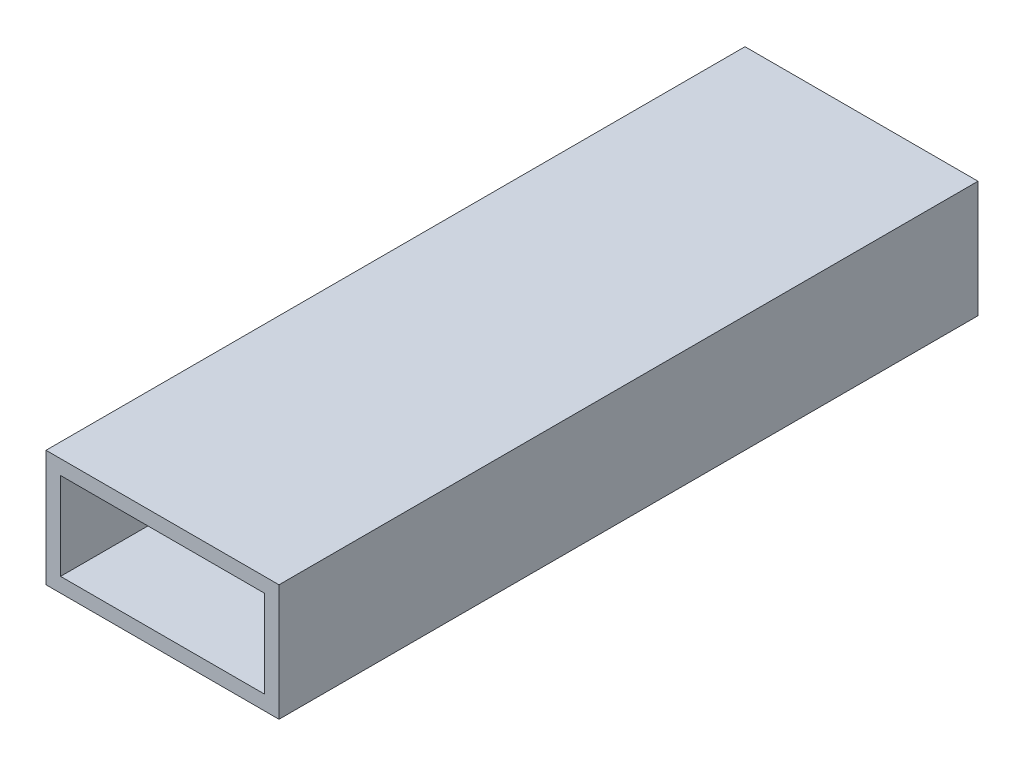
ISO-10303-21;
HEADER;
FILE_DESCRIPTION(('STEP AP214'),'2;1');
FILE_NAME('part.step','',(''),(''),'','','');
FILE_SCHEMA(('AUTOMOTIVE_DESIGN { 1 0 10303 214 1 1 1 1 }'));
ENDSEC;
DATA;
#1=APPLICATION_CONTEXT('core data for automotive mechanical design processes');
#2=APPLICATION_PROTOCOL_DEFINITION('international standard','automotive_design',2000,#1);
#3=PRODUCT_CONTEXT('',#1,'mechanical');
#4=PRODUCT('Part','Part','',(#3));
#5=PRODUCT_RELATED_PRODUCT_CATEGORY('part','',(#4));
#6=PRODUCT_DEFINITION_FORMATION('','',#4);
#7=PRODUCT_DEFINITION_CONTEXT('part definition',#1,'design');
#8=PRODUCT_DEFINITION('design','',#6,#7);
#9=PRODUCT_DEFINITION_SHAPE('','',#8);
#10=(LENGTH_UNIT() NAMED_UNIT(*) SI_UNIT(.MILLI.,.METRE.));
#11=(NAMED_UNIT(*) PLANE_ANGLE_UNIT() SI_UNIT($,.RADIAN.));
#12=(NAMED_UNIT(*) SI_UNIT($,.STERADIAN.) SOLID_ANGLE_UNIT());
#13=UNCERTAINTY_MEASURE_WITH_UNIT(LENGTH_MEASURE(1.E-05),#10,'distance_accuracy_value','');
#14=(GEOMETRIC_REPRESENTATION_CONTEXT(3) GLOBAL_UNCERTAINTY_ASSIGNED_CONTEXT((#13)) GLOBAL_UNIT_ASSIGNED_CONTEXT((#10,
#11,#12)) REPRESENTATION_CONTEXT('',''));
#15=CARTESIAN_POINT('',(0.,0.,0.));
#16=DIRECTION('',(0.,0.,1.));
#17=DIRECTION('',(1.,0.,0.));
#18=AXIS2_PLACEMENT_3D('',#15,#16,#17);
#19=CARTESIAN_POINT('',(0.,0.,152.4));
#20=DIRECTION('',(0.,0.,-1.));
#21=DIRECTION('',(-1.,0.,0.));
#22=AXIS2_PLACEMENT_3D('',#19,#20,#21);
#23=PLANE('',#22);
#24=DIRECTION('',(0.,1.,0.));
#25=VECTOR('',#24,1.);
#26=CARTESIAN_POINT('',(25.4,-12.7,152.4));
#27=LINE('',#26,#25);
#28=CARTESIAN_POINT('',(25.4,-12.7,152.4));
#29=VERTEX_POINT('',#28);
#30=CARTESIAN_POINT('',(25.4,12.7,152.4));
#31=VERTEX_POINT('',#30);
#32=EDGE_CURVE('E134',#29,#31,#27,.T.);
#33=ORIENTED_EDGE('',*,*,#32,.T.);
#34=DIRECTION('',(-1.,0.,0.));
#35=VECTOR('',#34,1.);
#36=CARTESIAN_POINT('',(-25.4,12.7,152.4));
#37=LINE('',#36,#35);
#38=CARTESIAN_POINT('',(-25.4,12.7,152.4));
#39=VERTEX_POINT('',#38);
#40=EDGE_CURVE('E137',#31,#39,#37,.T.);
#41=ORIENTED_EDGE('',*,*,#40,.T.);
#42=DIRECTION('',(0.,-1.,0.));
#43=VECTOR('',#42,1.);
#44=CARTESIAN_POINT('',(-25.4,-12.7,152.4));
#45=LINE('',#44,#43);
#46=CARTESIAN_POINT('',(-25.4,-12.7,152.4));
#47=VERTEX_POINT('',#46);
#48=EDGE_CURVE('E140',#39,#47,#45,.T.);
#49=ORIENTED_EDGE('',*,*,#48,.T.);
#50=DIRECTION('',(1.,0.,0.));
#51=VECTOR('',#50,1.);
#52=CARTESIAN_POINT('',(-25.4,-12.7,152.4));
#53=LINE('',#52,#51);
#54=EDGE_CURVE('E142',#47,#29,#53,.T.);
#55=ORIENTED_EDGE('',*,*,#54,.T.);
#56=EDGE_LOOP('',(#33,#41,#49,#55));
#57=FACE_BOUND('',#56,.T.);
#58=DIRECTION('',(0.,-1.,0.));
#59=VECTOR('',#58,1.);
#60=CARTESIAN_POINT('',(-22.225,-9.525,152.4));
#61=LINE('',#60,#59);
#62=CARTESIAN_POINT('',(-22.225,9.525,152.4));
#63=VERTEX_POINT('',#62);
#64=CARTESIAN_POINT('',(-22.225,-9.525,152.4));
#65=VERTEX_POINT('',#64);
#66=EDGE_CURVE('E98',#63,#65,#61,.T.);
#67=ORIENTED_EDGE('',*,*,#66,.F.);
#68=DIRECTION('',(-1.,0.,0.));
#69=VECTOR('',#68,1.);
#70=CARTESIAN_POINT('',(-22.225,9.525,152.4));
#71=LINE('',#70,#69);
#72=CARTESIAN_POINT('',(22.225,9.525,152.4));
#73=VERTEX_POINT('',#72);
#74=EDGE_CURVE('E120',#73,#63,#71,.T.);
#75=ORIENTED_EDGE('',*,*,#74,.F.);
#76=DIRECTION('',(0.,1.,0.));
#77=VECTOR('',#76,1.);
#78=CARTESIAN_POINT('',(22.225,-9.525,152.4));
#79=LINE('',#78,#77);
#80=CARTESIAN_POINT('',(22.225,-9.525,152.4));
#81=VERTEX_POINT('',#80);
#82=EDGE_CURVE('E118',#81,#73,#79,.T.);
#83=ORIENTED_EDGE('',*,*,#82,.F.);
#84=DIRECTION('',(1.,0.,0.));
#85=VECTOR('',#84,1.);
#86=CARTESIAN_POINT('',(-22.225,-9.525,152.4));
#87=LINE('',#86,#85);
#88=EDGE_CURVE('E106',#65,#81,#87,.T.);
#89=ORIENTED_EDGE('',*,*,#88,.F.);
#90=EDGE_LOOP('',(#67,#75,#83,#89));
#91=FACE_BOUND('',#90,.T.);
#92=ADVANCED_FACE('F33',(#57,#91),#23,.F.);
#93=CARTESIAN_POINT('',(0.,0.,0.));
#94=DIRECTION('',(0.,0.,-1.));
#95=DIRECTION('',(-1.,0.,0.));
#96=AXIS2_PLACEMENT_3D('',#93,#94,#95);
#97=PLANE('',#96);
#98=DIRECTION('',(0.,1.,0.));
#99=VECTOR('',#98,1.);
#100=CARTESIAN_POINT('',(25.4,-12.7,0.));
#101=LINE('',#100,#99);
#102=CARTESIAN_POINT('',(25.4,-12.7,0.));
#103=VERTEX_POINT('',#102);
#104=CARTESIAN_POINT('',(25.4,12.7,0.));
#105=VERTEX_POINT('',#104);
#106=EDGE_CURVE('E114',#103,#105,#101,.T.);
#107=ORIENTED_EDGE('',*,*,#106,.F.);
#108=DIRECTION('',(1.,0.,0.));
#109=VECTOR('',#108,1.);
#110=CARTESIAN_POINT('',(-25.4,-12.7,0.));
#111=LINE('',#110,#109);
#112=CARTESIAN_POINT('',(-25.4,-12.7,0.));
#113=VERTEX_POINT('',#112);
#114=EDGE_CURVE('E138',#113,#103,#111,.T.);
#115=ORIENTED_EDGE('',*,*,#114,.F.);
#116=DIRECTION('',(0.,-1.,0.));
#117=VECTOR('',#116,1.);
#118=CARTESIAN_POINT('',(-25.4,-12.7,0.));
#119=LINE('',#118,#117);
#120=CARTESIAN_POINT('',(-25.4,12.7,0.));
#121=VERTEX_POINT('',#120);
#122=EDGE_CURVE('E149',#121,#113,#119,.T.);
#123=ORIENTED_EDGE('',*,*,#122,.F.);
#124=DIRECTION('',(-1.,0.,0.));
#125=VECTOR('',#124,1.);
#126=CARTESIAN_POINT('',(-25.4,12.7,0.));
#127=LINE('',#126,#125);
#128=EDGE_CURVE('E147',#105,#121,#127,.T.);
#129=ORIENTED_EDGE('',*,*,#128,.F.);
#130=EDGE_LOOP('',(#107,#115,#123,#129));
#131=FACE_BOUND('',#130,.T.);
#132=DIRECTION('',(-1.,0.,0.));
#133=VECTOR('',#132,1.);
#134=CARTESIAN_POINT('',(-22.225,9.525,0.));
#135=LINE('',#134,#133);
#136=CARTESIAN_POINT('',(22.225,9.525,0.));
#137=VERTEX_POINT('',#136);
#138=CARTESIAN_POINT('',(-22.225,9.525,0.));
#139=VERTEX_POINT('',#138);
#140=EDGE_CURVE('E107',#137,#139,#135,.T.);
#141=ORIENTED_EDGE('',*,*,#140,.T.);
#142=DIRECTION('',(0.,-1.,0.));
#143=VECTOR('',#142,1.);
#144=CARTESIAN_POINT('',(-22.225,-9.525,0.));
#145=LINE('',#144,#143);
#146=CARTESIAN_POINT('',(-22.225,-9.525,0.));
#147=VERTEX_POINT('',#146);
#148=EDGE_CURVE('E56',#139,#147,#145,.T.);
#149=ORIENTED_EDGE('',*,*,#148,.T.);
#150=DIRECTION('',(1.,0.,0.));
#151=VECTOR('',#150,1.);
#152=CARTESIAN_POINT('',(-22.225,-9.525,0.));
#153=LINE('',#152,#151);
#154=CARTESIAN_POINT('',(22.225,-9.525,0.));
#155=VERTEX_POINT('',#154);
#156=EDGE_CURVE('E113',#147,#155,#153,.T.);
#157=ORIENTED_EDGE('',*,*,#156,.T.);
#158=DIRECTION('',(0.,1.,0.));
#159=VECTOR('',#158,1.);
#160=CARTESIAN_POINT('',(22.225,-9.525,0.));
#161=LINE('',#160,#159);
#162=EDGE_CURVE('E126',#155,#137,#161,.T.);
#163=ORIENTED_EDGE('',*,*,#162,.T.);
#164=EDGE_LOOP('',(#141,#149,#157,#163));
#165=FACE_BOUND('',#164,.T.);
#166=ADVANCED_FACE('F167',(#131,#165),#97,.T.);
#167=CARTESIAN_POINT('',(25.4,-12.7,152.4));
#168=DIRECTION('',(-1.,0.,0.));
#169=DIRECTION('',(0.,0.,1.));
#170=AXIS2_PLACEMENT_3D('',#167,#168,#169);
#171=PLANE('',#170);
#172=ORIENTED_EDGE('',*,*,#106,.T.);
#173=DIRECTION('',(0.,0.,-1.));
#174=VECTOR('',#173,1.);
#175=CARTESIAN_POINT('',(25.4,12.7,152.4));
#176=LINE('',#175,#174);
#177=EDGE_CURVE('E11',#31,#105,#176,.T.);
#178=ORIENTED_EDGE('',*,*,#177,.F.);
#179=ORIENTED_EDGE('',*,*,#32,.F.);
#180=DIRECTION('',(0.,0.,-1.));
#181=VECTOR('',#180,1.);
#182=CARTESIAN_POINT('',(25.4,-12.7,152.4));
#183=LINE('',#182,#181);
#184=EDGE_CURVE('E144',#29,#103,#183,.T.);
#185=ORIENTED_EDGE('',*,*,#184,.T.);
#186=EDGE_LOOP('',(#172,#178,#179,#185));
#187=FACE_BOUND('',#186,.T.);
#188=ADVANCED_FACE('F35',(#187),#171,.F.);
#189=CARTESIAN_POINT('',(-25.4,12.7,152.4));
#190=DIRECTION('',(0.,-1.,0.));
#191=DIRECTION('',(0.,0.,-1.));
#192=AXIS2_PLACEMENT_3D('',#189,#190,#191);
#193=PLANE('',#192);
#194=ORIENTED_EDGE('',*,*,#128,.T.);
#195=DIRECTION('',(0.,0.,-1.));
#196=VECTOR('',#195,1.);
#197=CARTESIAN_POINT('',(-25.4,12.7,152.4));
#198=LINE('',#197,#196);
#199=EDGE_CURVE('E41',#39,#121,#198,.T.);
#200=ORIENTED_EDGE('',*,*,#199,.F.);
#201=ORIENTED_EDGE('',*,*,#40,.F.);
#202=ORIENTED_EDGE('',*,*,#177,.T.);
#203=EDGE_LOOP('',(#194,#200,#201,#202));
#204=FACE_BOUND('',#203,.T.);
#205=ADVANCED_FACE('F177',(#204),#193,.F.);
#206=CARTESIAN_POINT('',(-25.4,-12.7,152.4));
#207=DIRECTION('',(1.,0.,0.));
#208=DIRECTION('',(0.,0.,-1.));
#209=AXIS2_PLACEMENT_3D('',#206,#207,#208);
#210=PLANE('',#209);
#211=ORIENTED_EDGE('',*,*,#122,.T.);
#212=DIRECTION('',(0.,0.,-1.));
#213=VECTOR('',#212,1.);
#214=CARTESIAN_POINT('',(-25.4,-12.7,152.4));
#215=LINE('',#214,#213);
#216=EDGE_CURVE('E154',#47,#113,#215,.T.);
#217=ORIENTED_EDGE('',*,*,#216,.F.);
#218=ORIENTED_EDGE('',*,*,#48,.F.);
#219=ORIENTED_EDGE('',*,*,#199,.T.);
#220=EDGE_LOOP('',(#211,#217,#218,#219));
#221=FACE_BOUND('',#220,.T.);
#222=ADVANCED_FACE('F161',(#221),#210,.F.);
#223=CARTESIAN_POINT('',(-25.4,-12.7,152.4));
#224=DIRECTION('',(0.,1.,0.));
#225=DIRECTION('',(-1.,0.,0.));
#226=AXIS2_PLACEMENT_3D('',#223,#224,#225);
#227=PLANE('',#226);
#228=ORIENTED_EDGE('',*,*,#114,.T.);
#229=ORIENTED_EDGE('',*,*,#184,.F.);
#230=ORIENTED_EDGE('',*,*,#54,.F.);
#231=ORIENTED_EDGE('',*,*,#216,.T.);
#232=EDGE_LOOP('',(#228,#229,#230,#231));
#233=FACE_BOUND('',#232,.T.);
#234=ADVANCED_FACE('F171',(#233),#227,.F.);
#235=CARTESIAN_POINT('',(-22.225,-9.525,152.4));
#236=DIRECTION('',(1.,0.,0.));
#237=DIRECTION('',(0.,0.,-1.));
#238=AXIS2_PLACEMENT_3D('',#235,#236,#237);
#239=PLANE('',#238);
#240=ORIENTED_EDGE('',*,*,#148,.F.);
#241=DIRECTION('',(0.,0.,-1.));
#242=VECTOR('',#241,1.);
#243=CARTESIAN_POINT('',(-22.225,9.525,152.4));
#244=LINE('',#243,#242);
#245=EDGE_CURVE('E102',#63,#139,#244,.T.);
#246=ORIENTED_EDGE('',*,*,#245,.F.);
#247=ORIENTED_EDGE('',*,*,#66,.T.);
#248=DIRECTION('',(0.,0.,-1.));
#249=VECTOR('',#248,1.);
#250=CARTESIAN_POINT('',(-22.225,-9.525,152.4));
#251=LINE('',#250,#249);
#252=EDGE_CURVE('E101',#65,#147,#251,.T.);
#253=ORIENTED_EDGE('',*,*,#252,.T.);
#254=EDGE_LOOP('',(#240,#246,#247,#253));
#255=FACE_BOUND('',#254,.T.);
#256=ADVANCED_FACE('F100',(#255),#239,.T.);
#257=CARTESIAN_POINT('',(-22.225,-9.525,152.4));
#258=DIRECTION('',(0.,1.,0.));
#259=DIRECTION('',(0.,0.,1.));
#260=AXIS2_PLACEMENT_3D('',#257,#258,#259);
#261=PLANE('',#260);
#262=ORIENTED_EDGE('',*,*,#156,.F.);
#263=ORIENTED_EDGE('',*,*,#252,.F.);
#264=ORIENTED_EDGE('',*,*,#88,.T.);
#265=DIRECTION('',(0.,0.,-1.));
#266=VECTOR('',#265,1.);
#267=CARTESIAN_POINT('',(22.225,-9.525,152.4));
#268=LINE('',#267,#266);
#269=EDGE_CURVE('E115',#81,#155,#268,.T.);
#270=ORIENTED_EDGE('',*,*,#269,.T.);
#271=EDGE_LOOP('',(#262,#263,#264,#270));
#272=FACE_BOUND('',#271,.T.);
#273=ADVANCED_FACE('F110',(#272),#261,.T.);
#274=CARTESIAN_POINT('',(22.225,-9.525,152.4));
#275=DIRECTION('',(-1.,0.,0.));
#276=DIRECTION('',(0.,-1.,0.));
#277=AXIS2_PLACEMENT_3D('',#274,#275,#276);
#278=PLANE('',#277);
#279=ORIENTED_EDGE('',*,*,#162,.F.);
#280=ORIENTED_EDGE('',*,*,#269,.F.);
#281=ORIENTED_EDGE('',*,*,#82,.T.);
#282=DIRECTION('',(0.,0.,-1.));
#283=VECTOR('',#282,1.);
#284=CARTESIAN_POINT('',(22.225,9.525,152.4));
#285=LINE('',#284,#283);
#286=EDGE_CURVE('E48',#73,#137,#285,.T.);
#287=ORIENTED_EDGE('',*,*,#286,.T.);
#288=EDGE_LOOP('',(#279,#280,#281,#287));
#289=FACE_BOUND('',#288,.T.);
#290=ADVANCED_FACE('F200',(#289),#278,.T.);
#291=CARTESIAN_POINT('',(-22.225,9.525,152.4));
#292=DIRECTION('',(0.,-1.,0.));
#293=DIRECTION('',(0.,0.,-1.));
#294=AXIS2_PLACEMENT_3D('',#291,#292,#293);
#295=PLANE('',#294);
#296=ORIENTED_EDGE('',*,*,#140,.F.);
#297=ORIENTED_EDGE('',*,*,#286,.F.);
#298=ORIENTED_EDGE('',*,*,#74,.T.);
#299=ORIENTED_EDGE('',*,*,#245,.T.);
#300=EDGE_LOOP('',(#296,#297,#298,#299));
#301=FACE_BOUND('',#300,.T.);
#302=ADVANCED_FACE('F204',(#301),#295,.T.);
#303=CLOSED_SHELL('',(#92,#166,#188,#205,#222,#234,#256,#273,#290,#302));
#304=MANIFOLD_SOLID_BREP('B2',#303);
#305=ADVANCED_BREP_SHAPE_REPRESENTATION('',(#18,#304),#14);
#306=SHAPE_DEFINITION_REPRESENTATION(#9,#305);
ENDSEC;
END-ISO-10303-21;
